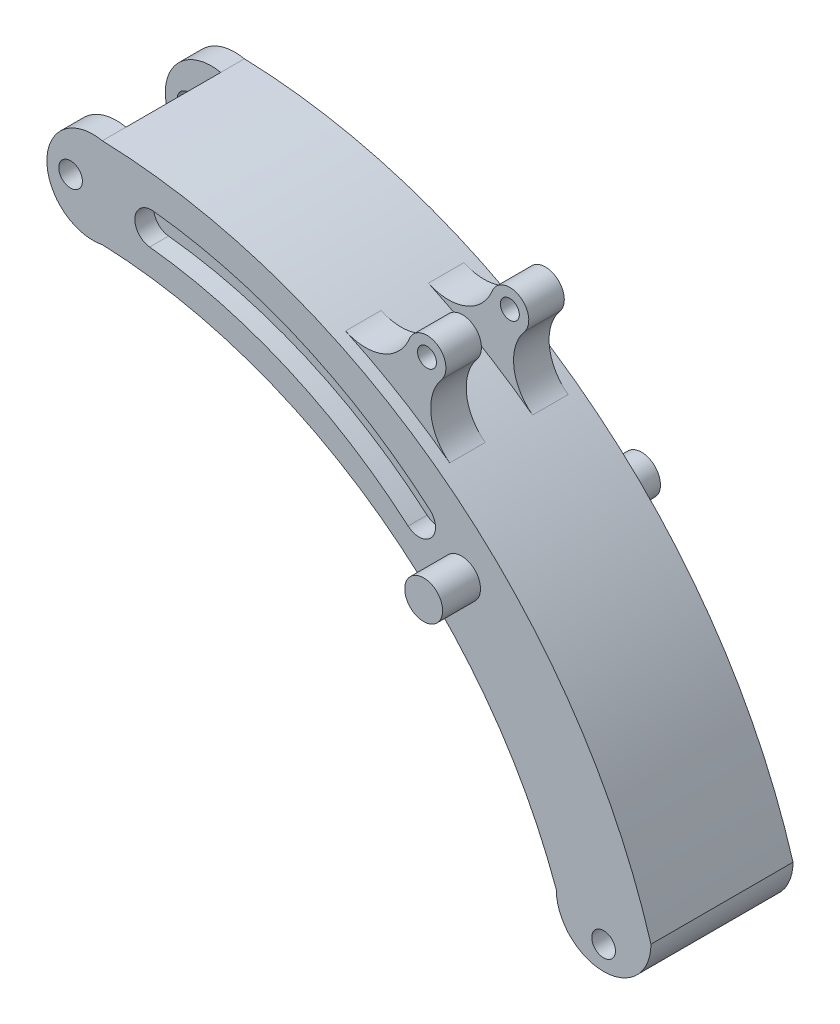
ISO-10303-21;
HEADER;
FILE_DESCRIPTION(('STEP AP214'),'2;1');
FILE_NAME('part.step','',(''),(''),'','','');
FILE_SCHEMA(('AUTOMOTIVE_DESIGN { 1 0 10303 214 1 1 1 1 }'));
ENDSEC;
DATA;
#1=APPLICATION_CONTEXT('core data for automotive mechanical design processes');
#2=APPLICATION_PROTOCOL_DEFINITION('international standard','automotive_design',2000,#1);
#3=PRODUCT_CONTEXT('',#1,'mechanical');
#4=PRODUCT('Part','Part','',(#3));
#5=PRODUCT_RELATED_PRODUCT_CATEGORY('part','',(#4));
#6=PRODUCT_DEFINITION_FORMATION('','',#4);
#7=PRODUCT_DEFINITION_CONTEXT('part definition',#1,'design');
#8=PRODUCT_DEFINITION('design','',#6,#7);
#9=PRODUCT_DEFINITION_SHAPE('','',#8);
#10=(LENGTH_UNIT() NAMED_UNIT(*) SI_UNIT(.MILLI.,.METRE.));
#11=(NAMED_UNIT(*) PLANE_ANGLE_UNIT() SI_UNIT($,.RADIAN.));
#12=(NAMED_UNIT(*) SI_UNIT($,.STERADIAN.) SOLID_ANGLE_UNIT());
#13=UNCERTAINTY_MEASURE_WITH_UNIT(LENGTH_MEASURE(1.E-05),#10,'distance_accuracy_value','');
#14=(GEOMETRIC_REPRESENTATION_CONTEXT(3) GLOBAL_UNCERTAINTY_ASSIGNED_CONTEXT((#13)) GLOBAL_UNIT_ASSIGNED_CONTEXT((#10,
#11,#12)) REPRESENTATION_CONTEXT('',''));
#15=CARTESIAN_POINT('',(0.,0.,0.));
#16=DIRECTION('',(0.,0.,1.));
#17=DIRECTION('',(1.,0.,0.));
#18=AXIS2_PLACEMENT_3D('',#15,#16,#17);
#19=CARTESIAN_POINT('',(-99.725,-35.9294360517946,-15.));
#20=DIRECTION('',(0.,0.,1.));
#21=DIRECTION('',(1.,0.,0.));
#22=AXIS2_PLACEMENT_3D('',#19,#20,#21);
#23=PLANE('',#22);
#24=CARTESIAN_POINT('',(10.,-5.,-15.));
#25=DIRECTION('',(0.,0.,1.));
#26=DIRECTION('',(1.,0.,0.));
#27=AXIS2_PLACEMENT_3D('',#24,#25,#26);
#28=CIRCLE('',#27,2.5);
#29=CARTESIAN_POINT('',(12.5,-5.,-15.));
#30=VERTEX_POINT('',#29);
#31=EDGE_CURVE('E313',#30,#30,#28,.T.);
#32=ORIENTED_EDGE('',*,*,#31,.T.);
#33=EDGE_LOOP('',(#32));
#34=FACE_BOUND('',#33,.T.);
#35=CARTESIAN_POINT('',(-99.725,-35.9294360517946,-15.));
#36=DIRECTION('',(0.,0.,-1.));
#37=DIRECTION('',(1.,0.,0.));
#38=AXIS2_PLACEMENT_3D('',#35,#36,#37);
#39=CIRCLE('',#38,106.);
#40=CARTESIAN_POINT('',(-95.8578850872054,70.,-15.));
#41=VERTEX_POINT('',#40);
#42=CARTESIAN_POINT('',(0.,0.,-15.));
#43=VERTEX_POINT('',#42);
#44=EDGE_CURVE('E219',#41,#43,#39,.T.);
#45=ORIENTED_EDGE('',*,*,#44,.F.);
#46=CARTESIAN_POINT('',(-97.8578850872054,79.5053656587178,-15.));
#47=DIRECTION('',(0.,0.,1.));
#48=DIRECTION('',(1.,0.,0.));
#49=AXIS2_PLACEMENT_3D('',#46,#47,#48);
#50=CIRCLE('',#49,9.71349454655384);
#51=CARTESIAN_POINT('',(-95.8578850872054,89.0107313174356,-15.));
#52=VERTEX_POINT('',#51);
#53=EDGE_CURVE('E256',#52,#41,#50,.T.);
#54=ORIENTED_EDGE('',*,*,#53,.F.);
#55=CARTESIAN_POINT('',(-99.725,-35.9294360517946,-15.));
#56=DIRECTION('',(0.,0.,1.));
#57=DIRECTION('',(1.,0.,0.));
#58=AXIS2_PLACEMENT_3D('',#55,#56,#57);
#59=CIRCLE('',#58,125.);
#60=CARTESIAN_POINT('',(20.,0.,-15.));
#61=VERTEX_POINT('',#60);
#62=EDGE_CURVE('E215',#61,#52,#59,.T.);
#63=ORIENTED_EDGE('',*,*,#62,.F.);
#64=CARTESIAN_POINT('',(10.,0.,-15.));
#65=DIRECTION('',(0.,0.,1.));
#66=DIRECTION('',(1.,0.,0.));
#67=AXIS2_PLACEMENT_3D('',#64,#65,#66);
#68=CIRCLE('',#67,10.);
#69=EDGE_CURVE('E204',#43,#61,#68,.T.);
#70=ORIENTED_EDGE('',*,*,#69,.F.);
#71=EDGE_LOOP('',(#45,#54,#63,#70));
#72=FACE_BOUND('',#71,.T.);
#73=CARTESIAN_POINT('',(-102.571379633759,79.5053656587178,-15.));
#74=DIRECTION('',(0.,0.,1.));
#75=DIRECTION('',(1.,0.,0.));
#76=AXIS2_PLACEMENT_3D('',#73,#74,#75);
#77=CIRCLE('',#76,2.5);
#78=CARTESIAN_POINT('',(-100.071379633759,79.5053656587178,-15.));
#79=VERTEX_POINT('',#78);
#80=EDGE_CURVE('E250',#79,#79,#77,.T.);
#81=ORIENTED_EDGE('',*,*,#80,.T.);
#82=EDGE_LOOP('',(#81));
#83=FACE_BOUND('',#82,.T.);
#84=CARTESIAN_POINT('',(-20.,47.,-15.));
#85=DIRECTION('',(0.,0.,1.));
#86=DIRECTION('',(1.,0.,0.));
#87=AXIS2_PLACEMENT_3D('',#84,#85,#86);
#88=CIRCLE('',#87,4.);
#89=CARTESIAN_POINT('',(-16.,47.,-15.));
#90=VERTEX_POINT('',#89);
#91=EDGE_CURVE('E394',#90,#90,#88,.T.);
#92=ORIENTED_EDGE('',*,*,#91,.T.);
#93=EDGE_LOOP('',(#92));
#94=FACE_BOUND('',#93,.T.);
#95=CARTESIAN_POINT('',(-29.,53.4795924352659,-15.));
#96=DIRECTION('',(0.,0.,1.));
#97=DIRECTION('',(1.,0.,0.));
#98=AXIS2_PLACEMENT_3D('',#95,#96,#97);
#99=CIRCLE('',#98,3.49999999999999);
#100=CARTESIAN_POINT('',(-31.2881692614736,50.8311435626525,-15.));
#101=VERTEX_POINT('',#100);
#102=CARTESIAN_POINT('',(-26.7118307385264,56.1280413078794,-15.));
#103=VERTEX_POINT('',#102);
#104=EDGE_CURVE('E60',#101,#103,#99,.T.);
#105=ORIENTED_EDGE('',*,*,#104,.T.);
#106=CARTESIAN_POINT('',(-96.6681693313984,-24.8431478423218,-15.));
#107=DIRECTION('',(0.,0.,1.));
#108=DIRECTION('',(1.,0.,0.));
#109=AXIS2_PLACEMENT_3D('',#106,#107,#108);
#110=CIRCLE('',#109,107.005713780705);
#111=CARTESIAN_POINT('',(-85.1223532862861,81.5378509947385,-15.));
#112=VERTEX_POINT('',#111);
#113=EDGE_CURVE('E326',#103,#112,#110,.T.);
#114=ORIENTED_EDGE('',*,*,#113,.T.);
#115=CARTESIAN_POINT('',(-85.5,78.0582845045532,-15.));
#116=DIRECTION('',(0.,0.,1.));
#117=DIRECTION('',(1.,0.,0.));
#118=AXIS2_PLACEMENT_3D('',#115,#116,#117);
#119=CIRCLE('',#118,3.49999999999999);
#120=CARTESIAN_POINT('',(-85.8776467137139,74.5787180143678,-15.));
#121=VERTEX_POINT('',#120);
#122=EDGE_CURVE('E342',#112,#121,#119,.T.);
#123=ORIENTED_EDGE('',*,*,#122,.T.);
#124=CARTESIAN_POINT('',(-96.6681693313984,-24.8431478423218,-15.));
#125=DIRECTION('',(0.,0.,-1.));
#126=DIRECTION('',(1.,0.,0.));
#127=AXIS2_PLACEMENT_3D('',#124,#125,#126);
#128=CIRCLE('',#127,100.005713780705);
#129=EDGE_CURVE('E338',#121,#101,#128,.T.);
#130=ORIENTED_EDGE('',*,*,#129,.T.);
#131=EDGE_LOOP('',(#105,#114,#123,#130));
#132=FACE_BOUND('',#131,.T.);
#133=ADVANCED_FACE('F42',(#34,#72,#83,#94,#132),#23,.F.);
#134=CARTESIAN_POINT('',(-42.782,86.47356534523,12.5));
#135=DIRECTION('',(0.,0.,-1.));
#136=DIRECTION('',(-1.,0.,0.));
#137=AXIS2_PLACEMENT_3D('',#134,#135,#136);
#138=CYLINDRICAL_SURFACE('',#137,10.);
#139=CARTESIAN_POINT('',(-42.782,86.47356534523,-5.));
#140=DIRECTION('',(0.,0.,-1.));
#141=DIRECTION('',(1.,0.,0.));
#142=AXIS2_PLACEMENT_3D('',#139,#140,#141);
#143=CIRCLE('',#142,10.);
#144=CARTESIAN_POINT('',(-33.5119035937337,82.7231903481757,-5.));
#145=VERTEX_POINT('',#144);
#146=CARTESIAN_POINT('',(-47.,77.4066763528578,-5.));
#147=VERTEX_POINT('',#146);
#148=EDGE_CURVE('E438',#145,#147,#143,.T.);
#149=ORIENTED_EDGE('',*,*,#148,.F.);
#150=DIRECTION('',(0.,0.,-1.));
#151=VECTOR('',#150,1.);
#152=CARTESIAN_POINT('',(-33.5119035937337,82.7231903481757,12.5));
#153=LINE('',#152,#151);
#154=CARTESIAN_POINT('',(-33.5119035937337,82.7231903481757,-12.5));
#155=VERTEX_POINT('',#154);
#156=EDGE_CURVE('E474',#145,#155,#153,.T.);
#157=ORIENTED_EDGE('',*,*,#156,.T.);
#158=CARTESIAN_POINT('',(-42.782,86.47356534523,-12.5));
#159=DIRECTION('',(0.,0.,-1.));
#160=DIRECTION('',(1.,0.,0.));
#161=AXIS2_PLACEMENT_3D('',#158,#159,#160);
#162=CIRCLE('',#161,10.);
#163=CARTESIAN_POINT('',(-47.,77.4066763528578,-12.5));
#164=VERTEX_POINT('',#163);
#165=EDGE_CURVE('E444',#155,#164,#162,.T.);
#166=ORIENTED_EDGE('',*,*,#165,.T.);
#167=DIRECTION('',(0.,0.,-1.));
#168=VECTOR('',#167,1.);
#169=CARTESIAN_POINT('',(-47.,77.4066763528578,12.5));
#170=LINE('',#169,#168);
#171=EDGE_CURVE('E501',#147,#164,#170,.T.);
#172=ORIENTED_EDGE('',*,*,#171,.F.);
#173=EDGE_LOOP('',(#149,#157,#166,#172));
#174=FACE_BOUND('',#173,.T.);
#175=ADVANCED_FACE('F549',(#174),#138,.F.);
#176=CARTESIAN_POINT('',(-19.022,72.292677173738,12.5));
#177=DIRECTION('',(0.,0.,-1.));
#178=DIRECTION('',(-1.,0.,0.));
#179=AXIS2_PLACEMENT_3D('',#176,#177,#178);
#180=CYLINDRICAL_SURFACE('',#179,10.);
#181=CARTESIAN_POINT('',(-19.022,72.292677173738,-5.));
#182=DIRECTION('',(0.,0.,-1.));
#183=DIRECTION('',(1.,0.,0.));
#184=AXIS2_PLACEMENT_3D('',#181,#182,#183);
#185=CIRCLE('',#184,10.);
#186=CARTESIAN_POINT('',(-25.,64.2762243422171,-5.));
#187=VERTEX_POINT('',#186);
#188=CARTESIAN_POINT('',(-26.7233321651623,78.6715080134637,-5.));
#189=VERTEX_POINT('',#188);
#190=EDGE_CURVE('E431',#187,#189,#185,.T.);
#191=ORIENTED_EDGE('',*,*,#190,.F.);
#192=DIRECTION('',(0.,0.,-1.));
#193=VECTOR('',#192,1.);
#194=CARTESIAN_POINT('',(-25.,64.276224342217,12.5));
#195=LINE('',#194,#193);
#196=CARTESIAN_POINT('',(-25.,64.2762243422171,-12.5));
#197=VERTEX_POINT('',#196);
#198=EDGE_CURVE('E497',#187,#197,#195,.T.);
#199=ORIENTED_EDGE('',*,*,#198,.T.);
#200=CARTESIAN_POINT('',(-19.022,72.292677173738,-12.5));
#201=DIRECTION('',(0.,0.,-1.));
#202=DIRECTION('',(-1.,0.,0.));
#203=AXIS2_PLACEMENT_3D('',#200,#201,#202);
#204=CIRCLE('',#203,10.);
#205=CARTESIAN_POINT('',(-26.7233321651623,78.6715080134637,-12.5));
#206=VERTEX_POINT('',#205);
#207=EDGE_CURVE('E482',#197,#206,#204,.T.);
#208=ORIENTED_EDGE('',*,*,#207,.T.);
#209=DIRECTION('',(0.,0.,-1.));
#210=VECTOR('',#209,1.);
#211=CARTESIAN_POINT('',(-26.7233321651623,78.6715080134637,12.5));
#212=LINE('',#211,#210);
#213=EDGE_CURVE('E493',#189,#206,#212,.T.);
#214=ORIENTED_EDGE('',*,*,#213,.F.);
#215=EDGE_LOOP('',(#191,#199,#208,#214));
#216=FACE_BOUND('',#215,.T.);
#217=ADVANCED_FACE('F509',(#216),#180,.F.);
#218=CARTESIAN_POINT('',(-29.8038650312273,81.223040349354,12.5));
#219=DIRECTION('',(0.,0.,-1.));
#220=DIRECTION('',(-1.,0.,0.));
#221=AXIS2_PLACEMENT_3D('',#218,#219,#220);
#222=CYLINDRICAL_SURFACE('',#221,4.);
#223=CARTESIAN_POINT('',(-29.8038650312273,81.223040349354,-5.));
#224=DIRECTION('',(0.,0.,1.));
#225=DIRECTION('',(1.,0.,0.));
#226=AXIS2_PLACEMENT_3D('',#223,#224,#225);
#227=CIRCLE('',#226,4.);
#228=EDGE_CURVE('E434',#189,#145,#227,.T.);
#229=ORIENTED_EDGE('',*,*,#228,.F.);
#230=ORIENTED_EDGE('',*,*,#213,.T.);
#231=CARTESIAN_POINT('',(-29.8038650312273,81.223040349354,-12.5));
#232=DIRECTION('',(0.,0.,1.));
#233=DIRECTION('',(1.,0.,0.));
#234=AXIS2_PLACEMENT_3D('',#231,#232,#233);
#235=CIRCLE('',#234,4.);
#236=EDGE_CURVE('E464',#206,#155,#235,.T.);
#237=ORIENTED_EDGE('',*,*,#236,.T.);
#238=ORIENTED_EDGE('',*,*,#156,.F.);
#239=EDGE_LOOP('',(#229,#230,#237,#238));
#240=FACE_BOUND('',#239,.T.);
#241=ADVANCED_FACE('F523',(#240),#222,.T.);
#242=CARTESIAN_POINT('',(-95.8578850872054,89.0107313174356,15.));
#243=DIRECTION('',(1.,0.,0.));
#244=DIRECTION('',(0.,1.,0.));
#245=AXIS2_PLACEMENT_3D('',#242,#243,#244);
#246=PLANE('',#245);
#247=DIRECTION('',(0.,1.,0.));
#248=VECTOR('',#247,1.);
#249=CARTESIAN_POINT('',(-95.8578850872054,89.0107313174356,-10.));
#250=LINE('',#249,#248);
#251=CARTESIAN_POINT('',(-95.8578850872054,70.,-10.));
#252=VERTEX_POINT('',#251);
#253=CARTESIAN_POINT('',(-95.8578850872054,89.0107313174356,-10.));
#254=VERTEX_POINT('',#253);
#255=EDGE_CURVE('E274',#252,#254,#250,.T.);
#256=ORIENTED_EDGE('',*,*,#255,.F.);
#257=DIRECTION('',(0.,0.,-1.));
#258=VECTOR('',#257,1.);
#259=CARTESIAN_POINT('',(-95.8578850872054,70.,15.));
#260=LINE('',#259,#258);
#261=CARTESIAN_POINT('',(-95.8578850872054,70.,10.));
#262=VERTEX_POINT('',#261);
#263=EDGE_CURVE('E241',#262,#252,#260,.T.);
#264=ORIENTED_EDGE('',*,*,#263,.F.);
#265=DIRECTION('',(0.,1.,0.));
#266=VECTOR('',#265,1.);
#267=CARTESIAN_POINT('',(-95.8578850872054,89.0107313174356,10.));
#268=LINE('',#267,#266);
#269=CARTESIAN_POINT('',(-95.8578850872054,89.0107313174356,10.));
#270=VERTEX_POINT('',#269);
#271=EDGE_CURVE('E227',#262,#270,#268,.T.);
#272=ORIENTED_EDGE('',*,*,#271,.T.);
#273=DIRECTION('',(0.,0.,-1.));
#274=VECTOR('',#273,1.);
#275=CARTESIAN_POINT('',(-95.8578850872054,89.0107313174356,15.));
#276=LINE('',#275,#274);
#277=EDGE_CURVE('E240',#270,#254,#276,.T.);
#278=ORIENTED_EDGE('',*,*,#277,.T.);
#279=EDGE_LOOP('',(#256,#264,#272,#278));
#280=FACE_BOUND('',#279,.T.);
#281=ADVANCED_FACE('F300',(#280),#246,.F.);
#282=CARTESIAN_POINT('',(-99.725,-35.9294360517946,15.));
#283=DIRECTION('',(0.,0.,-1.));
#284=DIRECTION('',(-1.,0.,0.));
#285=AXIS2_PLACEMENT_3D('',#282,#283,#284);
#286=CYLINDRICAL_SURFACE('',#285,106.);
#287=ORIENTED_EDGE('',*,*,#44,.T.);
#288=DIRECTION('',(0.,0.,-1.));
#289=VECTOR('',#288,1.);
#290=CARTESIAN_POINT('',(0.,0.,15.));
#291=LINE('',#290,#289);
#292=CARTESIAN_POINT('',(0.,0.,15.));
#293=VERTEX_POINT('',#292);
#294=EDGE_CURVE('E11',#293,#43,#291,.T.);
#295=ORIENTED_EDGE('',*,*,#294,.F.);
#296=CARTESIAN_POINT('',(-99.725,-35.9294360517946,15.));
#297=DIRECTION('',(0.,0.,-1.));
#298=DIRECTION('',(1.,0.,0.));
#299=AXIS2_PLACEMENT_3D('',#296,#297,#298);
#300=CIRCLE('',#299,106.);
#301=CARTESIAN_POINT('',(-95.8578850872054,70.,15.));
#302=VERTEX_POINT('',#301);
#303=EDGE_CURVE('E207',#302,#293,#300,.T.);
#304=ORIENTED_EDGE('',*,*,#303,.F.);
#305=EDGE_CURVE('E237',#302,#262,#260,.T.);
#306=ORIENTED_EDGE('',*,*,#305,.T.);
#307=ORIENTED_EDGE('',*,*,#263,.T.);
#308=DIRECTION('',(0.,0.,-1.));
#309=VECTOR('',#308,1.);
#310=CARTESIAN_POINT('',(-95.8578850872054,70.,-10.));
#311=LINE('',#310,#309);
#312=EDGE_CURVE('E222',#252,#41,#311,.T.);
#313=ORIENTED_EDGE('',*,*,#312,.T.);
#314=EDGE_LOOP('',(#287,#295,#304,#306,#307,#313));
#315=FACE_BOUND('',#314,.T.);
#316=ADVANCED_FACE('F44',(#315),#286,.F.);
#317=CARTESIAN_POINT('',(-99.725,-35.9294360517946,15.));
#318=DIRECTION('',(0.,0.,-1.));
#319=DIRECTION('',(-1.,0.,0.));
#320=AXIS2_PLACEMENT_3D('',#317,#318,#319);
#321=CYLINDRICAL_SURFACE('',#320,125.);
#322=CARTESIAN_POINT('',(-47.,77.4066763528578,12.5));
#323=VERTEX_POINT('',#322);
#324=CARTESIAN_POINT('',(-47.,77.4066763528578,5.));
#325=VERTEX_POINT('',#324);
#326=EDGE_CURVE('E265',#323,#325,#170,.T.);
#327=ORIENTED_EDGE('',*,*,#326,.T.);
#328=CARTESIAN_POINT('',(-99.725,-35.9294360517946,5.));
#329=DIRECTION('',(0.,0.,-1.));
#330=DIRECTION('',(1.,0.,0.));
#331=AXIS2_PLACEMENT_3D('',#328,#329,#330);
#332=CIRCLE('',#331,125.);
#333=CARTESIAN_POINT('',(-25.,64.2762243422171,5.));
#334=VERTEX_POINT('',#333);
#335=EDGE_CURVE('E435',#325,#334,#332,.T.);
#336=ORIENTED_EDGE('',*,*,#335,.T.);
#337=CARTESIAN_POINT('',(-25.,64.2762243422171,12.5));
#338=VERTEX_POINT('',#337);
#339=EDGE_CURVE('E498',#338,#334,#195,.T.);
#340=ORIENTED_EDGE('',*,*,#339,.F.);
#341=CARTESIAN_POINT('',(-99.725,-35.9294360517946,12.5));
#342=DIRECTION('',(0.,0.,-1.));
#343=DIRECTION('',(1.,0.,0.));
#344=AXIS2_PLACEMENT_3D('',#341,#342,#343);
#345=CIRCLE('',#344,125.);
#346=EDGE_CURVE('E463',#323,#338,#345,.T.);
#347=ORIENTED_EDGE('',*,*,#346,.F.);
#348=EDGE_LOOP('',(#327,#336,#340,#347));
#349=FACE_BOUND('',#348,.T.);
#350=CARTESIAN_POINT('',(-99.725,-35.9294360517946,-5.));
#351=DIRECTION('',(0.,0.,-1.));
#352=DIRECTION('',(1.,0.,0.));
#353=AXIS2_PLACEMENT_3D('',#350,#351,#352);
#354=CIRCLE('',#353,125.);
#355=EDGE_CURVE('E441',#147,#187,#354,.T.);
#356=ORIENTED_EDGE('',*,*,#355,.F.);
#357=ORIENTED_EDGE('',*,*,#171,.T.);
#358=CARTESIAN_POINT('',(-99.725,-35.9294360517946,-12.5));
#359=DIRECTION('',(0.,0.,-1.));
#360=DIRECTION('',(1.,0.,0.));
#361=AXIS2_PLACEMENT_3D('',#358,#359,#360);
#362=CIRCLE('',#361,125.);
#363=EDGE_CURVE('E478',#164,#197,#362,.T.);
#364=ORIENTED_EDGE('',*,*,#363,.T.);
#365=ORIENTED_EDGE('',*,*,#198,.F.);
#366=EDGE_LOOP('',(#356,#357,#364,#365));
#367=FACE_BOUND('',#366,.T.);
#368=ORIENTED_EDGE('',*,*,#62,.T.);
#369=DIRECTION('',(0.,0.,-1.));
#370=VECTOR('',#369,1.);
#371=CARTESIAN_POINT('',(-95.8578850872054,89.0107313174356,-10.));
#372=LINE('',#371,#370);
#373=EDGE_CURVE('E278',#254,#52,#372,.T.);
#374=ORIENTED_EDGE('',*,*,#373,.F.);
#375=ORIENTED_EDGE('',*,*,#277,.F.);
#376=CARTESIAN_POINT('',(-95.8578850872054,89.0107313174356,15.));
#377=VERTEX_POINT('',#376);
#378=EDGE_CURVE('E242',#377,#270,#276,.T.);
#379=ORIENTED_EDGE('',*,*,#378,.F.);
#380=CARTESIAN_POINT('',(-99.725,-35.9294360517946,15.));
#381=DIRECTION('',(0.,0.,1.));
#382=DIRECTION('',(1.,0.,0.));
#383=AXIS2_PLACEMENT_3D('',#380,#381,#382);
#384=CIRCLE('',#383,125.);
#385=CARTESIAN_POINT('',(20.,0.,15.));
#386=VERTEX_POINT('',#385);
#387=EDGE_CURVE('E214',#386,#377,#384,.T.);
#388=ORIENTED_EDGE('',*,*,#387,.F.);
#389=DIRECTION('',(0.,0.,-1.));
#390=VECTOR('',#389,1.);
#391=CARTESIAN_POINT('',(20.,0.,15.));
#392=LINE('',#391,#390);
#393=EDGE_CURVE('E52',#386,#61,#392,.T.);
#394=ORIENTED_EDGE('',*,*,#393,.T.);
#395=EDGE_LOOP('',(#368,#374,#375,#379,#388,#394));
#396=FACE_BOUND('',#395,.T.);
#397=ADVANCED_FACE('F304',(#349,#367,#396),#321,.T.);
#398=CARTESIAN_POINT('',(-99.725,-35.9294360517946,15.));
#399=DIRECTION('',(0.,0.,1.));
#400=DIRECTION('',(1.,0.,0.));
#401=AXIS2_PLACEMENT_3D('',#398,#399,#400);
#402=PLANE('',#401);
#403=CARTESIAN_POINT('',(10.,-5.,15.));
#404=DIRECTION('',(0.,0.,1.));
#405=DIRECTION('',(1.,0.,0.));
#406=AXIS2_PLACEMENT_3D('',#403,#404,#405);
#407=CIRCLE('',#406,2.5);
#408=CARTESIAN_POINT('',(12.5,-5.,15.));
#409=VERTEX_POINT('',#408);
#410=EDGE_CURVE('E317',#409,#409,#407,.T.);
#411=ORIENTED_EDGE('',*,*,#410,.F.);
#412=EDGE_LOOP('',(#411));
#413=FACE_BOUND('',#412,.T.);
#414=CARTESIAN_POINT('',(-29.,53.4795924352659,15.));
#415=DIRECTION('',(0.,0.,1.));
#416=DIRECTION('',(1.,0.,0.));
#417=AXIS2_PLACEMENT_3D('',#414,#415,#416);
#418=CIRCLE('',#417,3.49999999999999);
#419=CARTESIAN_POINT('',(-31.2881692614736,50.8311435626525,15.));
#420=VERTEX_POINT('',#419);
#421=CARTESIAN_POINT('',(-26.7118307385264,56.1280413078794,15.));
#422=VERTEX_POINT('',#421);
#423=EDGE_CURVE('E68',#420,#422,#418,.T.);
#424=ORIENTED_EDGE('',*,*,#423,.F.);
#425=CARTESIAN_POINT('',(-96.6681693313984,-24.8431478423218,15.));
#426=DIRECTION('',(0.,0.,-1.));
#427=DIRECTION('',(1.,0.,0.));
#428=AXIS2_PLACEMENT_3D('',#425,#426,#427);
#429=CIRCLE('',#428,100.005713780705);
#430=CARTESIAN_POINT('',(-85.8776467137139,74.5787180143678,15.));
#431=VERTEX_POINT('',#430);
#432=EDGE_CURVE('E365',#431,#420,#429,.T.);
#433=ORIENTED_EDGE('',*,*,#432,.F.);
#434=CARTESIAN_POINT('',(-85.5,78.0582845045532,15.));
#435=DIRECTION('',(0.,0.,1.));
#436=DIRECTION('',(1.,0.,0.));
#437=AXIS2_PLACEMENT_3D('',#434,#435,#436);
#438=CIRCLE('',#437,3.49999999999999);
#439=CARTESIAN_POINT('',(-85.1223532862861,81.5378509947385,15.));
#440=VERTEX_POINT('',#439);
#441=EDGE_CURVE('E384',#440,#431,#438,.T.);
#442=ORIENTED_EDGE('',*,*,#441,.F.);
#443=CARTESIAN_POINT('',(-96.6681693313984,-24.8431478423218,15.));
#444=DIRECTION('',(0.,0.,1.));
#445=DIRECTION('',(1.,0.,0.));
#446=AXIS2_PLACEMENT_3D('',#443,#444,#445);
#447=CIRCLE('',#446,107.005713780705);
#448=EDGE_CURVE('E380',#422,#440,#447,.T.);
#449=ORIENTED_EDGE('',*,*,#448,.F.);
#450=EDGE_LOOP('',(#424,#433,#442,#449));
#451=FACE_BOUND('',#450,.T.);
#452=CARTESIAN_POINT('',(-20.,47.,15.));
#453=DIRECTION('',(0.,0.,1.));
#454=DIRECTION('',(1.,0.,0.));
#455=AXIS2_PLACEMENT_3D('',#452,#453,#454);
#456=CIRCLE('',#455,4.);
#457=CARTESIAN_POINT('',(-16.,47.,15.));
#458=VERTEX_POINT('',#457);
#459=EDGE_CURVE('E407',#458,#458,#456,.T.);
#460=ORIENTED_EDGE('',*,*,#459,.F.);
#461=EDGE_LOOP('',(#460));
#462=FACE_BOUND('',#461,.T.);
#463=CARTESIAN_POINT('',(-102.571379633759,79.5053656587178,15.));
#464=DIRECTION('',(0.,0.,1.));
#465=DIRECTION('',(1.,0.,0.));
#466=AXIS2_PLACEMENT_3D('',#463,#464,#465);
#467=CIRCLE('',#466,2.5);
#468=CARTESIAN_POINT('',(-100.071379633759,79.5053656587178,15.));
#469=VERTEX_POINT('',#468);
#470=EDGE_CURVE('E259',#469,#469,#467,.T.);
#471=ORIENTED_EDGE('',*,*,#470,.F.);
#472=EDGE_LOOP('',(#471));
#473=FACE_BOUND('',#472,.T.);
#474=ORIENTED_EDGE('',*,*,#303,.T.);
#475=CARTESIAN_POINT('',(10.,0.,15.));
#476=DIRECTION('',(0.,0.,1.));
#477=DIRECTION('',(1.,0.,0.));
#478=AXIS2_PLACEMENT_3D('',#475,#476,#477);
#479=CIRCLE('',#478,10.);
#480=EDGE_CURVE('E194',#293,#386,#479,.T.);
#481=ORIENTED_EDGE('',*,*,#480,.T.);
#482=ORIENTED_EDGE('',*,*,#387,.T.);
#483=CARTESIAN_POINT('',(-97.8578850872054,79.5053656587178,15.));
#484=DIRECTION('',(0.,0.,1.));
#485=DIRECTION('',(1.,0.,0.));
#486=AXIS2_PLACEMENT_3D('',#483,#484,#485);
#487=CIRCLE('',#486,9.71349454655384);
#488=EDGE_CURVE('E209',#377,#302,#487,.T.);
#489=ORIENTED_EDGE('',*,*,#488,.T.);
#490=EDGE_LOOP('',(#474,#481,#482,#489));
#491=FACE_BOUND('',#490,.T.);
#492=ADVANCED_FACE('F208',(#413,#451,#462,#473,#491),#402,.T.);
#493=CARTESIAN_POINT('',(-97.8578850872054,79.5053656587178,10.));
#494=DIRECTION('',(0.,0.,1.));
#495=DIRECTION('',(1.,0.,0.));
#496=AXIS2_PLACEMENT_3D('',#493,#494,#495);
#497=CYLINDRICAL_SURFACE('',#496,9.71349454655384);
#498=ORIENTED_EDGE('',*,*,#488,.F.);
#499=ORIENTED_EDGE('',*,*,#378,.T.);
#500=CARTESIAN_POINT('',(-97.8578850872054,79.5053656587178,10.));
#501=DIRECTION('',(0.,0.,1.));
#502=DIRECTION('',(1.,0.,0.));
#503=AXIS2_PLACEMENT_3D('',#500,#501,#502);
#504=CIRCLE('',#503,9.71349454655384);
#505=EDGE_CURVE('E233',#270,#262,#504,.T.);
#506=ORIENTED_EDGE('',*,*,#505,.T.);
#507=ORIENTED_EDGE('',*,*,#305,.F.);
#508=EDGE_LOOP('',(#498,#499,#506,#507));
#509=FACE_BOUND('',#508,.T.);
#510=ADVANCED_FACE('F292',(#509),#497,.T.);
#511=CARTESIAN_POINT('',(-97.8578850872054,79.5053656587178,10.));
#512=DIRECTION('',(0.,0.,1.));
#513=DIRECTION('',(1.,0.,0.));
#514=AXIS2_PLACEMENT_3D('',#511,#512,#513);
#515=PLANE('',#514);
#516=CARTESIAN_POINT('',(-102.571379633759,79.5053656587178,10.));
#517=DIRECTION('',(0.,0.,1.));
#518=DIRECTION('',(1.,0.,0.));
#519=AXIS2_PLACEMENT_3D('',#516,#517,#518);
#520=CIRCLE('',#519,2.5);
#521=CARTESIAN_POINT('',(-100.071379633759,79.5053656587178,10.));
#522=VERTEX_POINT('',#521);
#523=EDGE_CURVE('E249',#522,#522,#520,.T.);
#524=ORIENTED_EDGE('',*,*,#523,.T.);
#525=EDGE_LOOP('',(#524));
#526=FACE_BOUND('',#525,.T.);
#527=ORIENTED_EDGE('',*,*,#505,.F.);
#528=ORIENTED_EDGE('',*,*,#271,.F.);
#529=EDGE_LOOP('',(#527,#528));
#530=FACE_BOUND('',#529,.T.);
#531=ADVANCED_FACE('F296',(#526,#530),#515,.F.);
#532=CARTESIAN_POINT('',(-97.8578850872054,79.5053656587178,-10.));
#533=DIRECTION('',(0.,0.,-1.));
#534=DIRECTION('',(-1.,0.,0.));
#535=AXIS2_PLACEMENT_3D('',#532,#533,#534);
#536=CYLINDRICAL_SURFACE('',#535,9.71349454655384);
#537=ORIENTED_EDGE('',*,*,#53,.T.);
#538=ORIENTED_EDGE('',*,*,#312,.F.);
#539=CARTESIAN_POINT('',(-97.8578850872054,79.5053656587178,-10.));
#540=DIRECTION('',(0.,0.,1.));
#541=DIRECTION('',(1.,0.,0.));
#542=AXIS2_PLACEMENT_3D('',#539,#540,#541);
#543=CIRCLE('',#542,9.71349454655384);
#544=EDGE_CURVE('E270',#254,#252,#543,.T.);
#545=ORIENTED_EDGE('',*,*,#544,.F.);
#546=ORIENTED_EDGE('',*,*,#373,.T.);
#547=EDGE_LOOP('',(#537,#538,#545,#546));
#548=FACE_BOUND('',#547,.T.);
#549=ADVANCED_FACE('F310',(#548),#536,.T.);
#550=CARTESIAN_POINT('',(-97.8578850872054,79.5053656587178,-10.));
#551=DIRECTION('',(0.,0.,-1.));
#552=DIRECTION('',(1.,0.,0.));
#553=AXIS2_PLACEMENT_3D('',#550,#551,#552);
#554=PLANE('',#553);
#555=CARTESIAN_POINT('',(-102.571379633759,79.5053656587178,-10.));
#556=DIRECTION('',(0.,0.,-1.));
#557=DIRECTION('',(-1.,0.,0.));
#558=AXIS2_PLACEMENT_3D('',#555,#556,#557);
#559=CIRCLE('',#558,2.5);
#560=CARTESIAN_POINT('',(-105.071379633759,79.5053656587178,-10.));
#561=VERTEX_POINT('',#560);
#562=EDGE_CURVE('E246',#561,#561,#559,.T.);
#563=ORIENTED_EDGE('',*,*,#562,.T.);
#564=EDGE_LOOP('',(#563));
#565=FACE_BOUND('',#564,.T.);
#566=ORIENTED_EDGE('',*,*,#544,.T.);
#567=ORIENTED_EDGE('',*,*,#255,.T.);
#568=EDGE_LOOP('',(#566,#567));
#569=FACE_BOUND('',#568,.T.);
#570=ADVANCED_FACE('F308',(#565,#569),#554,.F.);
#571=CARTESIAN_POINT('',(-102.571379633759,79.5053656587178,-15.));
#572=DIRECTION('',(0.,0.,1.));
#573=DIRECTION('',(1.,0.,0.));
#574=AXIS2_PLACEMENT_3D('',#571,#572,#573);
#575=CYLINDRICAL_SURFACE('',#574,2.5);
#576=ORIENTED_EDGE('',*,*,#80,.F.);
#577=EDGE_LOOP('',(#576));
#578=FACE_BOUND('',#577,.T.);
#579=ORIENTED_EDGE('',*,*,#562,.F.);
#580=EDGE_LOOP('',(#579));
#581=FACE_BOUND('',#580,.T.);
#582=ADVANCED_FACE('F600',(#578,#581),#575,.F.);
#583=ORIENTED_EDGE('',*,*,#470,.T.);
#584=EDGE_LOOP('',(#583));
#585=FACE_BOUND('',#584,.T.);
#586=ORIENTED_EDGE('',*,*,#523,.F.);
#587=EDGE_LOOP('',(#586));
#588=FACE_BOUND('',#587,.T.);
#589=ADVANCED_FACE('F597',(#585,#588),#575,.F.);
#590=CARTESIAN_POINT('',(-33.5119035937337,82.7231903481757,12.5));
#591=VERTEX_POINT('',#590);
#592=CARTESIAN_POINT('',(-33.5119035937337,82.7231903481757,5.));
#593=VERTEX_POINT('',#592);
#594=EDGE_CURVE('E489',#591,#593,#153,.T.);
#595=ORIENTED_EDGE('',*,*,#594,.T.);
#596=CARTESIAN_POINT('',(-42.782,86.47356534523,5.));
#597=DIRECTION('',(0.,0.,-1.));
#598=DIRECTION('',(1.,0.,0.));
#599=AXIS2_PLACEMENT_3D('',#596,#597,#598);
#600=CIRCLE('',#599,10.);
#601=EDGE_CURVE('E452',#593,#325,#600,.T.);
#602=ORIENTED_EDGE('',*,*,#601,.T.);
#603=ORIENTED_EDGE('',*,*,#326,.F.);
#604=CARTESIAN_POINT('',(-42.782,86.47356534523,12.5));
#605=DIRECTION('',(0.,0.,-1.));
#606=DIRECTION('',(1.,0.,0.));
#607=AXIS2_PLACEMENT_3D('',#604,#605,#606);
#608=CIRCLE('',#607,10.);
#609=EDGE_CURVE('E459',#591,#323,#608,.T.);
#610=ORIENTED_EDGE('',*,*,#609,.F.);
#611=EDGE_LOOP('',(#595,#602,#603,#610));
#612=FACE_BOUND('',#611,.T.);
#613=ADVANCED_FACE('F557',(#612),#138,.F.);
#614=ORIENTED_EDGE('',*,*,#339,.T.);
#615=CARTESIAN_POINT('',(-19.022,72.292677173738,5.));
#616=DIRECTION('',(0.,0.,-1.));
#617=DIRECTION('',(1.,0.,0.));
#618=AXIS2_PLACEMENT_3D('',#615,#616,#617);
#619=CIRCLE('',#618,10.);
#620=CARTESIAN_POINT('',(-26.7233321651623,78.6715080134637,5.));
#621=VERTEX_POINT('',#620);
#622=EDGE_CURVE('E430',#334,#621,#619,.T.);
#623=ORIENTED_EDGE('',*,*,#622,.T.);
#624=CARTESIAN_POINT('',(-26.7233321651623,78.6715080134637,12.5));
#625=VERTEX_POINT('',#624);
#626=EDGE_CURVE('E494',#625,#621,#212,.T.);
#627=ORIENTED_EDGE('',*,*,#626,.F.);
#628=CARTESIAN_POINT('',(-19.022,72.292677173738,12.5));
#629=DIRECTION('',(0.,0.,-1.));
#630=DIRECTION('',(-1.,0.,0.));
#631=AXIS2_PLACEMENT_3D('',#628,#629,#630);
#632=CIRCLE('',#631,10.);
#633=EDGE_CURVE('E468',#338,#625,#632,.T.);
#634=ORIENTED_EDGE('',*,*,#633,.F.);
#635=EDGE_LOOP('',(#614,#623,#627,#634));
#636=FACE_BOUND('',#635,.T.);
#637=ADVANCED_FACE('F579',(#636),#180,.F.);
#638=ORIENTED_EDGE('',*,*,#626,.T.);
#639=CARTESIAN_POINT('',(-29.8038650312273,81.223040349354,5.));
#640=DIRECTION('',(0.,0.,1.));
#641=DIRECTION('',(1.,0.,0.));
#642=AXIS2_PLACEMENT_3D('',#639,#640,#641);
#643=CIRCLE('',#642,4.);
#644=EDGE_CURVE('E448',#621,#593,#643,.T.);
#645=ORIENTED_EDGE('',*,*,#644,.T.);
#646=ORIENTED_EDGE('',*,*,#594,.F.);
#647=CARTESIAN_POINT('',(-29.8038650312273,81.223040349354,12.5));
#648=DIRECTION('',(0.,0.,1.));
#649=DIRECTION('',(1.,0.,0.));
#650=AXIS2_PLACEMENT_3D('',#647,#648,#649);
#651=CIRCLE('',#650,4.);
#652=EDGE_CURVE('E471',#625,#591,#651,.T.);
#653=ORIENTED_EDGE('',*,*,#652,.F.);
#654=EDGE_LOOP('',(#638,#645,#646,#653));
#655=FACE_BOUND('',#654,.T.);
#656=ADVANCED_FACE('F576',(#655),#222,.T.);
#657=CARTESIAN_POINT('',(-36.2929325156136,83.848302847292,12.5));
#658=DIRECTION('',(0.,0.,1.));
#659=DIRECTION('',(1.,0.,0.));
#660=AXIS2_PLACEMENT_3D('',#657,#658,#659);
#661=PLANE('',#660);
#662=CARTESIAN_POINT('',(-29.8038650312273,81.223040349354,12.5));
#663=DIRECTION('',(0.,0.,1.));
#664=DIRECTION('',(1.,0.,0.));
#665=AXIS2_PLACEMENT_3D('',#662,#663,#664);
#666=CIRCLE('',#665,2.);
#667=CARTESIAN_POINT('',(-27.8038650312272,81.223040349354,12.5));
#668=VERTEX_POINT('',#667);
#669=EDGE_CURVE('E415',#668,#668,#666,.T.);
#670=ORIENTED_EDGE('',*,*,#669,.F.);
#671=EDGE_LOOP('',(#670));
#672=FACE_BOUND('',#671,.T.);
#673=ORIENTED_EDGE('',*,*,#609,.T.);
#674=ORIENTED_EDGE('',*,*,#346,.T.);
#675=ORIENTED_EDGE('',*,*,#633,.T.);
#676=ORIENTED_EDGE('',*,*,#652,.T.);
#677=EDGE_LOOP('',(#673,#674,#675,#676));
#678=FACE_BOUND('',#677,.T.);
#679=ADVANCED_FACE('F581',(#672,#678),#661,.T.);
#680=CARTESIAN_POINT('',(-36.2929325156136,83.848302847292,-12.5));
#681=DIRECTION('',(0.,0.,1.));
#682=DIRECTION('',(1.,0.,0.));
#683=AXIS2_PLACEMENT_3D('',#680,#681,#682);
#684=PLANE('',#683);
#685=CARTESIAN_POINT('',(-29.8038650312273,81.223040349354,-12.5));
#686=DIRECTION('',(0.,0.,1.));
#687=DIRECTION('',(1.,0.,0.));
#688=AXIS2_PLACEMENT_3D('',#685,#686,#687);
#689=CIRCLE('',#688,2.);
#690=CARTESIAN_POINT('',(-27.8038650312272,81.223040349354,-12.5));
#691=VERTEX_POINT('',#690);
#692=EDGE_CURVE('E426',#691,#691,#689,.T.);
#693=ORIENTED_EDGE('',*,*,#692,.T.);
#694=EDGE_LOOP('',(#693));
#695=FACE_BOUND('',#694,.T.);
#696=ORIENTED_EDGE('',*,*,#165,.F.);
#697=ORIENTED_EDGE('',*,*,#236,.F.);
#698=ORIENTED_EDGE('',*,*,#207,.F.);
#699=ORIENTED_EDGE('',*,*,#363,.F.);
#700=EDGE_LOOP('',(#696,#697,#698,#699));
#701=FACE_BOUND('',#700,.T.);
#702=ADVANCED_FACE('F519',(#695,#701),#684,.F.);
#703=CARTESIAN_POINT('',(-59.3735,18.1816205609717,-5.));
#704=DIRECTION('',(0.,0.,1.));
#705=DIRECTION('',(1.,0.,0.));
#706=AXIS2_PLACEMENT_3D('',#703,#704,#705);
#707=PLANE('',#706);
#708=CARTESIAN_POINT('',(-29.8038650312273,81.223040349354,-5.));
#709=DIRECTION('',(0.,0.,1.));
#710=DIRECTION('',(1.,0.,0.));
#711=AXIS2_PLACEMENT_3D('',#708,#709,#710);
#712=CIRCLE('',#711,2.);
#713=CARTESIAN_POINT('',(-27.8038650312272,81.223040349354,-5.));
#714=VERTEX_POINT('',#713);
#715=EDGE_CURVE('E422',#714,#714,#712,.T.);
#716=ORIENTED_EDGE('',*,*,#715,.F.);
#717=EDGE_LOOP('',(#716));
#718=FACE_BOUND('',#717,.T.);
#719=ORIENTED_EDGE('',*,*,#190,.T.);
#720=ORIENTED_EDGE('',*,*,#228,.T.);
#721=ORIENTED_EDGE('',*,*,#148,.T.);
#722=ORIENTED_EDGE('',*,*,#355,.T.);
#723=EDGE_LOOP('',(#719,#720,#721,#722));
#724=FACE_BOUND('',#723,.T.);
#725=ADVANCED_FACE('F544',(#718,#724),#707,.T.);
#726=CARTESIAN_POINT('',(-59.3735,18.1816205609717,5.));
#727=DIRECTION('',(0.,0.,1.));
#728=DIRECTION('',(1.,0.,0.));
#729=AXIS2_PLACEMENT_3D('',#726,#727,#728);
#730=PLANE('',#729);
#731=CARTESIAN_POINT('',(-29.8038650312273,81.223040349354,5.));
#732=DIRECTION('',(0.,0.,1.));
#733=DIRECTION('',(1.,0.,0.));
#734=AXIS2_PLACEMENT_3D('',#731,#732,#733);
#735=CIRCLE('',#734,2.);
#736=CARTESIAN_POINT('',(-27.8038650312272,81.223040349354,5.));
#737=VERTEX_POINT('',#736);
#738=EDGE_CURVE('E46',#737,#737,#735,.T.);
#739=ORIENTED_EDGE('',*,*,#738,.T.);
#740=EDGE_LOOP('',(#739));
#741=FACE_BOUND('',#740,.T.);
#742=ORIENTED_EDGE('',*,*,#622,.F.);
#743=ORIENTED_EDGE('',*,*,#335,.F.);
#744=ORIENTED_EDGE('',*,*,#601,.F.);
#745=ORIENTED_EDGE('',*,*,#644,.F.);
#746=EDGE_LOOP('',(#742,#743,#744,#745));
#747=FACE_BOUND('',#746,.T.);
#748=ADVANCED_FACE('F530',(#741,#747),#730,.F.);
#749=CARTESIAN_POINT('',(-29.8038650312273,81.223040349354,-15.));
#750=DIRECTION('',(0.,0.,1.));
#751=DIRECTION('',(1.,0.,0.));
#752=AXIS2_PLACEMENT_3D('',#749,#750,#751);
#753=CYLINDRICAL_SURFACE('',#752,2.);
#754=ORIENTED_EDGE('',*,*,#669,.T.);
#755=EDGE_LOOP('',(#754));
#756=FACE_BOUND('',#755,.T.);
#757=ORIENTED_EDGE('',*,*,#738,.F.);
#758=EDGE_LOOP('',(#757));
#759=FACE_BOUND('',#758,.T.);
#760=ADVANCED_FACE('F533',(#756,#759),#753,.F.);
#761=ORIENTED_EDGE('',*,*,#715,.T.);
#762=EDGE_LOOP('',(#761));
#763=FACE_BOUND('',#762,.T.);
#764=ORIENTED_EDGE('',*,*,#692,.F.);
#765=EDGE_LOOP('',(#764));
#766=FACE_BOUND('',#765,.T.);
#767=ADVANCED_FACE('F535',(#763,#766),#753,.F.);
#768=CARTESIAN_POINT('',(-20.,47.,23.));
#769=DIRECTION('',(0.,0.,-1.));
#770=DIRECTION('',(-1.,0.,0.));
#771=AXIS2_PLACEMENT_3D('',#768,#769,#770);
#772=CYLINDRICAL_SURFACE('',#771,4.);
#773=CARTESIAN_POINT('',(-20.,47.,23.));
#774=DIRECTION('',(0.,0.,1.));
#775=DIRECTION('',(1.,0.,0.));
#776=AXIS2_PLACEMENT_3D('',#773,#774,#775);
#777=CIRCLE('',#776,4.);
#778=CARTESIAN_POINT('',(-16.,47.,23.));
#779=VERTEX_POINT('',#778);
#780=EDGE_CURVE('E411',#779,#779,#777,.T.);
#781=ORIENTED_EDGE('',*,*,#780,.F.);
#782=EDGE_LOOP('',(#781));
#783=FACE_BOUND('',#782,.T.);
#784=ORIENTED_EDGE('',*,*,#459,.T.);
#785=EDGE_LOOP('',(#784));
#786=FACE_BOUND('',#785,.T.);
#787=ADVANCED_FACE('F542',(#783,#786),#772,.T.);
#788=CARTESIAN_POINT('',(-20.,47.,23.));
#789=DIRECTION('',(0.,0.,1.));
#790=DIRECTION('',(1.,0.,0.));
#791=AXIS2_PLACEMENT_3D('',#788,#789,#790);
#792=PLANE('',#791);
#793=ORIENTED_EDGE('',*,*,#780,.T.);
#794=EDGE_LOOP('',(#793));
#795=FACE_BOUND('',#794,.T.);
#796=ADVANCED_FACE('F702',(#795),#792,.T.);
#797=CARTESIAN_POINT('',(-20.,47.,-23.));
#798=DIRECTION('',(0.,0.,1.));
#799=DIRECTION('',(1.,0.,0.));
#800=AXIS2_PLACEMENT_3D('',#797,#798,#799);
#801=CYLINDRICAL_SURFACE('',#800,4.);
#802=CARTESIAN_POINT('',(-20.,47.,-23.));
#803=DIRECTION('',(0.,0.,1.));
#804=DIRECTION('',(1.,0.,0.));
#805=AXIS2_PLACEMENT_3D('',#802,#803,#804);
#806=CIRCLE('',#805,4.);
#807=CARTESIAN_POINT('',(-16.,47.,-23.));
#808=VERTEX_POINT('',#807);
#809=EDGE_CURVE('E403',#808,#808,#806,.T.);
#810=ORIENTED_EDGE('',*,*,#809,.T.);
#811=EDGE_LOOP('',(#810));
#812=FACE_BOUND('',#811,.T.);
#813=ORIENTED_EDGE('',*,*,#91,.F.);
#814=EDGE_LOOP('',(#813));
#815=FACE_BOUND('',#814,.T.);
#816=ADVANCED_FACE('F712',(#812,#815),#801,.T.);
#817=CARTESIAN_POINT('',(-20.,47.,-23.));
#818=DIRECTION('',(0.,0.,-1.));
#819=DIRECTION('',(1.,0.,0.));
#820=AXIS2_PLACEMENT_3D('',#817,#818,#819);
#821=PLANE('',#820);
#822=ORIENTED_EDGE('',*,*,#809,.F.);
#823=EDGE_LOOP('',(#822));
#824=FACE_BOUND('',#823,.T.);
#825=ADVANCED_FACE('F723',(#824),#821,.T.);
#826=CARTESIAN_POINT('',(-29.,53.4795924352659,11.));
#827=DIRECTION('',(0.,0.,1.));
#828=DIRECTION('',(1.,0.,0.));
#829=AXIS2_PLACEMENT_3D('',#826,#827,#828);
#830=CYLINDRICAL_SURFACE('',#829,3.49999999999999);
#831=ORIENTED_EDGE('',*,*,#423,.T.);
#832=DIRECTION('',(0.,0.,1.));
#833=VECTOR('',#832,1.);
#834=CARTESIAN_POINT('',(-26.7118307385264,56.1280413078794,11.));
#835=LINE('',#834,#833);
#836=CARTESIAN_POINT('',(-26.7118307385264,56.1280413078794,11.));
#837=VERTEX_POINT('',#836);
#838=EDGE_CURVE('E377',#837,#422,#835,.T.);
#839=ORIENTED_EDGE('',*,*,#838,.F.);
#840=CARTESIAN_POINT('',(-29.,53.4795924352659,11.));
#841=DIRECTION('',(0.,0.,1.));
#842=DIRECTION('',(1.,0.,0.));
#843=AXIS2_PLACEMENT_3D('',#840,#841,#842);
#844=CIRCLE('',#843,3.49999999999999);
#845=CARTESIAN_POINT('',(-31.2881692614736,50.8311435626525,11.));
#846=VERTEX_POINT('',#845);
#847=EDGE_CURVE('E360',#846,#837,#844,.T.);
#848=ORIENTED_EDGE('',*,*,#847,.F.);
#849=DIRECTION('',(0.,0.,1.));
#850=VECTOR('',#849,1.);
#851=CARTESIAN_POINT('',(-31.2881692614736,50.8311435626525,11.));
#852=LINE('',#851,#850);
#853=EDGE_CURVE('E391',#846,#420,#852,.T.);
#854=ORIENTED_EDGE('',*,*,#853,.T.);
#855=EDGE_LOOP('',(#831,#839,#848,#854));
#856=FACE_BOUND('',#855,.T.);
#857=ADVANCED_FACE('F734',(#856),#830,.F.);
#858=CARTESIAN_POINT('',(-96.6681693313984,-24.8431478423218,11.));
#859=DIRECTION('',(0.,0.,1.));
#860=DIRECTION('',(1.,0.,0.));
#861=AXIS2_PLACEMENT_3D('',#858,#859,#860);
#862=CYLINDRICAL_SURFACE('',#861,100.005713780705);
#863=ORIENTED_EDGE('',*,*,#432,.T.);
#864=ORIENTED_EDGE('',*,*,#853,.F.);
#865=CARTESIAN_POINT('',(-96.6681693313984,-24.8431478423218,11.));
#866=DIRECTION('',(0.,0.,-1.));
#867=DIRECTION('',(1.,0.,0.));
#868=AXIS2_PLACEMENT_3D('',#865,#866,#867);
#869=CIRCLE('',#868,100.005713780705);
#870=CARTESIAN_POINT('',(-85.8776467137139,74.5787180143678,11.));
#871=VERTEX_POINT('',#870);
#872=EDGE_CURVE('E373',#871,#846,#869,.T.);
#873=ORIENTED_EDGE('',*,*,#872,.F.);
#874=DIRECTION('',(0.,0.,1.));
#875=VECTOR('',#874,1.);
#876=CARTESIAN_POINT('',(-85.8776467137139,74.5787180143678,11.));
#877=LINE('',#876,#875);
#878=EDGE_CURVE('E395',#871,#431,#877,.T.);
#879=ORIENTED_EDGE('',*,*,#878,.T.);
#880=EDGE_LOOP('',(#863,#864,#873,#879));
#881=FACE_BOUND('',#880,.T.);
#882=ADVANCED_FACE('F745',(#881),#862,.T.);
#883=CARTESIAN_POINT('',(-85.5,78.0582845045532,11.));
#884=DIRECTION('',(0.,0.,1.));
#885=DIRECTION('',(1.,0.,0.));
#886=AXIS2_PLACEMENT_3D('',#883,#884,#885);
#887=CYLINDRICAL_SURFACE('',#886,3.49999999999999);
#888=ORIENTED_EDGE('',*,*,#441,.T.);
#889=ORIENTED_EDGE('',*,*,#878,.F.);
#890=CARTESIAN_POINT('',(-85.5,78.0582845045532,11.));
#891=DIRECTION('',(0.,0.,1.));
#892=DIRECTION('',(1.,0.,0.));
#893=AXIS2_PLACEMENT_3D('',#890,#891,#892);
#894=CIRCLE('',#893,3.49999999999999);
#895=CARTESIAN_POINT('',(-85.1223532862861,81.5378509947385,11.));
#896=VERTEX_POINT('',#895);
#897=EDGE_CURVE('E369',#896,#871,#894,.T.);
#898=ORIENTED_EDGE('',*,*,#897,.F.);
#899=DIRECTION('',(0.,0.,1.));
#900=VECTOR('',#899,1.);
#901=CARTESIAN_POINT('',(-85.1223532862861,81.5378509947385,11.));
#902=LINE('',#901,#900);
#903=EDGE_CURVE('E398',#896,#440,#902,.T.);
#904=ORIENTED_EDGE('',*,*,#903,.T.);
#905=EDGE_LOOP('',(#888,#889,#898,#904));
#906=FACE_BOUND('',#905,.T.);
#907=ADVANCED_FACE('F755',(#906),#887,.F.);
#908=CARTESIAN_POINT('',(-96.6681693313984,-24.8431478423218,11.));
#909=DIRECTION('',(0.,0.,1.));
#910=DIRECTION('',(1.,0.,0.));
#911=AXIS2_PLACEMENT_3D('',#908,#909,#910);
#912=CYLINDRICAL_SURFACE('',#911,107.005713780705);
#913=ORIENTED_EDGE('',*,*,#448,.T.);
#914=ORIENTED_EDGE('',*,*,#903,.F.);
#915=CARTESIAN_POINT('',(-96.6681693313984,-24.8431478423218,11.));
#916=DIRECTION('',(0.,0.,1.));
#917=DIRECTION('',(1.,0.,0.));
#918=AXIS2_PLACEMENT_3D('',#915,#916,#917);
#919=CIRCLE('',#918,107.005713780705);
#920=EDGE_CURVE('E364',#837,#896,#919,.T.);
#921=ORIENTED_EDGE('',*,*,#920,.F.);
#922=ORIENTED_EDGE('',*,*,#838,.T.);
#923=EDGE_LOOP('',(#913,#914,#921,#922));
#924=FACE_BOUND('',#923,.T.);
#925=ADVANCED_FACE('F766',(#924),#912,.F.);
#926=CARTESIAN_POINT('',(-62.8340846656992,14.3182222964721,11.));
#927=DIRECTION('',(0.,0.,1.));
#928=DIRECTION('',(1.,0.,0.));
#929=AXIS2_PLACEMENT_3D('',#926,#927,#928);
#930=PLANE('',#929);
#931=ORIENTED_EDGE('',*,*,#847,.T.);
#932=ORIENTED_EDGE('',*,*,#920,.T.);
#933=ORIENTED_EDGE('',*,*,#897,.T.);
#934=ORIENTED_EDGE('',*,*,#872,.T.);
#935=EDGE_LOOP('',(#931,#932,#933,#934));
#936=FACE_BOUND('',#935,.T.);
#937=ADVANCED_FACE('F777',(#936),#930,.T.);
#938=CARTESIAN_POINT('',(-29.,53.4795924352659,-11.));
#939=DIRECTION('',(0.,0.,-1.));
#940=DIRECTION('',(-1.,0.,0.));
#941=AXIS2_PLACEMENT_3D('',#938,#939,#940);
#942=CYLINDRICAL_SURFACE('',#941,3.49999999999999);
#943=ORIENTED_EDGE('',*,*,#104,.F.);
#944=DIRECTION('',(0.,0.,-1.));
#945=VECTOR('',#944,1.);
#946=CARTESIAN_POINT('',(-31.2881692614736,50.8311435626525,-11.));
#947=LINE('',#946,#945);
#948=CARTESIAN_POINT('',(-31.2881692614736,50.8311435626525,-11.));
#949=VERTEX_POINT('',#948);
#950=EDGE_CURVE('E335',#949,#101,#947,.T.);
#951=ORIENTED_EDGE('',*,*,#950,.F.);
#952=CARTESIAN_POINT('',(-29.,53.4795924352659,-11.));
#953=DIRECTION('',(0.,0.,1.));
#954=DIRECTION('',(1.,0.,0.));
#955=AXIS2_PLACEMENT_3D('',#952,#953,#954);
#956=CIRCLE('',#955,3.49999999999999);
#957=CARTESIAN_POINT('',(-26.7118307385264,56.1280413078794,-11.));
#958=VERTEX_POINT('',#957);
#959=EDGE_CURVE('E321',#949,#958,#956,.T.);
#960=ORIENTED_EDGE('',*,*,#959,.T.);
#961=DIRECTION('',(0.,0.,-1.));
#962=VECTOR('',#961,1.);
#963=CARTESIAN_POINT('',(-26.7118307385264,56.1280413078794,-11.));
#964=LINE('',#963,#962);
#965=EDGE_CURVE('E349',#958,#103,#964,.T.);
#966=ORIENTED_EDGE('',*,*,#965,.T.);
#967=EDGE_LOOP('',(#943,#951,#960,#966));
#968=FACE_BOUND('',#967,.T.);
#969=ADVANCED_FACE('F788',(#968),#942,.F.);
#970=CARTESIAN_POINT('',(-96.6681693313984,-24.8431478423218,-11.));
#971=DIRECTION('',(0.,0.,-1.));
#972=DIRECTION('',(-1.,0.,0.));
#973=AXIS2_PLACEMENT_3D('',#970,#971,#972);
#974=CYLINDRICAL_SURFACE('',#973,107.005713780705);
#975=ORIENTED_EDGE('',*,*,#113,.F.);
#976=ORIENTED_EDGE('',*,*,#965,.F.);
#977=CARTESIAN_POINT('',(-96.6681693313984,-24.8431478423218,-11.));
#978=DIRECTION('',(0.,0.,1.));
#979=DIRECTION('',(1.,0.,0.));
#980=AXIS2_PLACEMENT_3D('',#977,#978,#979);
#981=CIRCLE('',#980,107.005713780705);
#982=CARTESIAN_POINT('',(-85.1223532862861,81.5378509947385,-11.));
#983=VERTEX_POINT('',#982);
#984=EDGE_CURVE('E332',#958,#983,#981,.T.);
#985=ORIENTED_EDGE('',*,*,#984,.T.);
#986=DIRECTION('',(0.,0.,-1.));
#987=VECTOR('',#986,1.);
#988=CARTESIAN_POINT('',(-85.1223532862861,81.5378509947385,-11.));
#989=LINE('',#988,#987);
#990=EDGE_CURVE('E352',#983,#112,#989,.T.);
#991=ORIENTED_EDGE('',*,*,#990,.T.);
#992=EDGE_LOOP('',(#975,#976,#985,#991));
#993=FACE_BOUND('',#992,.T.);
#994=ADVANCED_FACE('F800',(#993),#974,.F.);
#995=CARTESIAN_POINT('',(-85.5,78.0582845045532,-11.));
#996=DIRECTION('',(0.,0.,-1.));
#997=DIRECTION('',(-1.,0.,0.));
#998=AXIS2_PLACEMENT_3D('',#995,#996,#997);
#999=CYLINDRICAL_SURFACE('',#998,3.49999999999999);
#1000=ORIENTED_EDGE('',*,*,#122,.F.);
#1001=ORIENTED_EDGE('',*,*,#990,.F.);
#1002=CARTESIAN_POINT('',(-85.5,78.0582845045532,-11.));
#1003=DIRECTION('',(0.,0.,1.));
#1004=DIRECTION('',(1.,0.,0.));
#1005=AXIS2_PLACEMENT_3D('',#1002,#1003,#1004);
#1006=CIRCLE('',#1005,3.49999999999999);
#1007=CARTESIAN_POINT('',(-85.8776467137139,74.5787180143678,-11.));
#1008=VERTEX_POINT('',#1007);
#1009=EDGE_CURVE('E329',#983,#1008,#1006,.T.);
#1010=ORIENTED_EDGE('',*,*,#1009,.T.);
#1011=DIRECTION('',(0.,0.,-1.));
#1012=VECTOR('',#1011,1.);
#1013=CARTESIAN_POINT('',(-85.8776467137139,74.5787180143678,-11.));
#1014=LINE('',#1013,#1012);
#1015=EDGE_CURVE('E355',#1008,#121,#1014,.T.);
#1016=ORIENTED_EDGE('',*,*,#1015,.T.);
#1017=EDGE_LOOP('',(#1000,#1001,#1010,#1016));
#1018=FACE_BOUND('',#1017,.T.);
#1019=ADVANCED_FACE('F811',(#1018),#999,.F.);
#1020=CARTESIAN_POINT('',(-96.6681693313984,-24.8431478423218,-11.));
#1021=DIRECTION('',(0.,0.,-1.));
#1022=DIRECTION('',(-1.,0.,0.));
#1023=AXIS2_PLACEMENT_3D('',#1020,#1021,#1022);
#1024=CYLINDRICAL_SURFACE('',#1023,100.005713780705);
#1025=ORIENTED_EDGE('',*,*,#129,.F.);
#1026=ORIENTED_EDGE('',*,*,#1015,.F.);
#1027=CARTESIAN_POINT('',(-96.6681693313984,-24.8431478423218,-11.));
#1028=DIRECTION('',(0.,0.,-1.));
#1029=DIRECTION('',(1.,0.,0.));
#1030=AXIS2_PLACEMENT_3D('',#1027,#1028,#1029);
#1031=CIRCLE('',#1030,100.005713780705);
#1032=EDGE_CURVE('E325',#1008,#949,#1031,.T.);
#1033=ORIENTED_EDGE('',*,*,#1032,.T.);
#1034=ORIENTED_EDGE('',*,*,#950,.T.);
#1035=EDGE_LOOP('',(#1025,#1026,#1033,#1034));
#1036=FACE_BOUND('',#1035,.T.);
#1037=ADVANCED_FACE('F822',(#1036),#1024,.T.);
#1038=CARTESIAN_POINT('',(-62.8340846656992,14.3182222964721,-11.));
#1039=DIRECTION('',(0.,0.,-1.));
#1040=DIRECTION('',(1.,0.,0.));
#1041=AXIS2_PLACEMENT_3D('',#1038,#1039,#1040);
#1042=PLANE('',#1041);
#1043=ORIENTED_EDGE('',*,*,#959,.F.);
#1044=ORIENTED_EDGE('',*,*,#1032,.F.);
#1045=ORIENTED_EDGE('',*,*,#1009,.F.);
#1046=ORIENTED_EDGE('',*,*,#984,.F.);
#1047=EDGE_LOOP('',(#1043,#1044,#1045,#1046));
#1048=FACE_BOUND('',#1047,.T.);
#1049=ADVANCED_FACE('F833',(#1048),#1042,.T.);
#1050=CARTESIAN_POINT('',(10.,0.,15.));
#1051=DIRECTION('',(0.,0.,-1.));
#1052=DIRECTION('',(-1.,0.,0.));
#1053=AXIS2_PLACEMENT_3D('',#1050,#1051,#1052);
#1054=CYLINDRICAL_SURFACE('',#1053,10.);
#1055=ORIENTED_EDGE('',*,*,#69,.T.);
#1056=ORIENTED_EDGE('',*,*,#393,.F.);
#1057=ORIENTED_EDGE('',*,*,#480,.F.);
#1058=ORIENTED_EDGE('',*,*,#294,.T.);
#1059=EDGE_LOOP('',(#1055,#1056,#1057,#1058));
#1060=FACE_BOUND('',#1059,.T.);
#1061=ADVANCED_FACE('F196',(#1060),#1054,.T.);
#1062=CARTESIAN_POINT('',(10.,-5.,-15.));
#1063=DIRECTION('',(0.,0.,1.));
#1064=DIRECTION('',(1.,0.,0.));
#1065=AXIS2_PLACEMENT_3D('',#1062,#1063,#1064);
#1066=CYLINDRICAL_SURFACE('',#1065,2.5);
#1067=ORIENTED_EDGE('',*,*,#31,.F.);
#1068=EDGE_LOOP('',(#1067));
#1069=FACE_BOUND('',#1068,.T.);
#1070=ORIENTED_EDGE('',*,*,#410,.T.);
#1071=EDGE_LOOP('',(#1070));
#1072=FACE_BOUND('',#1071,.T.);
#1073=ADVANCED_FACE('F866',(#1069,#1072),#1066,.F.);
#1074=CLOSED_SHELL('',(#133,#175,#217,#241,#281,#316,#397,#492,#510,#531,#549,#570,#582,#589,
#613,#637,#656,#679,#702,#725,#748,#760,#767,#787,#796,#816,#825,#857,#882,#907,#925,#937,#969,
#994,#1019,#1037,#1049,#1061,#1073));
#1075=MANIFOLD_SOLID_BREP('B2',#1074);
#1076=ADVANCED_BREP_SHAPE_REPRESENTATION('',(#18,#1075),#14);
#1077=SHAPE_DEFINITION_REPRESENTATION(#9,#1076);
ENDSEC;
END-ISO-10303-21;
